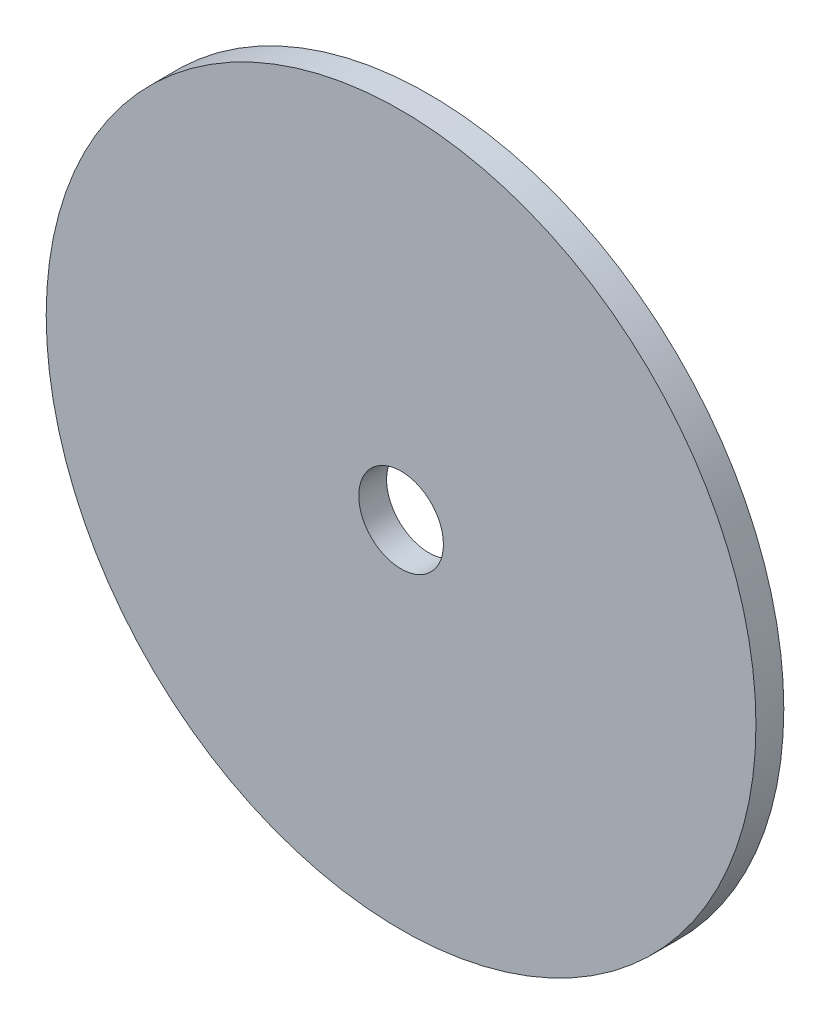
ISO-10303-21;
HEADER;
FILE_DESCRIPTION(('STEP AP214'),'2;1');
FILE_NAME('part.step','',(''),(''),'','','');
FILE_SCHEMA(('AUTOMOTIVE_DESIGN { 1 0 10303 214 1 1 1 1 }'));
ENDSEC;
DATA;
#1=APPLICATION_CONTEXT('core data for automotive mechanical design processes');
#2=APPLICATION_PROTOCOL_DEFINITION('international standard','automotive_design',2000,#1);
#3=PRODUCT_CONTEXT('',#1,'mechanical');
#4=PRODUCT('Part','Part','',(#3));
#5=PRODUCT_RELATED_PRODUCT_CATEGORY('part','',(#4));
#6=PRODUCT_DEFINITION_FORMATION('','',#4);
#7=PRODUCT_DEFINITION_CONTEXT('part definition',#1,'design');
#8=PRODUCT_DEFINITION('design','',#6,#7);
#9=PRODUCT_DEFINITION_SHAPE('','',#8);
#10=(LENGTH_UNIT() NAMED_UNIT(*) SI_UNIT(.MILLI.,.METRE.));
#11=(NAMED_UNIT(*) PLANE_ANGLE_UNIT() SI_UNIT($,.RADIAN.));
#12=(NAMED_UNIT(*) SI_UNIT($,.STERADIAN.) SOLID_ANGLE_UNIT());
#13=UNCERTAINTY_MEASURE_WITH_UNIT(LENGTH_MEASURE(1.E-05),#10,'distance_accuracy_value','');
#14=(GEOMETRIC_REPRESENTATION_CONTEXT(3) GLOBAL_UNCERTAINTY_ASSIGNED_CONTEXT((#13)) GLOBAL_UNIT_ASSIGNED_CONTEXT((#10,
#11,#12)) REPRESENTATION_CONTEXT('',''));
#15=CARTESIAN_POINT('',(0.,0.,0.));
#16=DIRECTION('',(0.,0.,1.));
#17=DIRECTION('',(1.,0.,0.));
#18=AXIS2_PLACEMENT_3D('',#15,#16,#17);
#19=CARTESIAN_POINT('',(0.,0.,5.));
#20=DIRECTION('',(0.,0.,1.));
#21=DIRECTION('',(1.,0.,0.));
#22=AXIS2_PLACEMENT_3D('',#19,#20,#21);
#23=PLANE('',#22);
#24=CARTESIAN_POINT('',(0.,0.,5.));
#25=DIRECTION('',(0.,0.,1.));
#26=DIRECTION('',(1.,0.,0.));
#27=AXIS2_PLACEMENT_3D('',#24,#25,#26);
#28=CIRCLE('',#27,63.7004065395242);
#29=CARTESIAN_POINT('',(63.7004065395242,0.,5.));
#30=VERTEX_POINT('',#29);
#31=EDGE_CURVE('E10',#30,#30,#28,.T.);
#32=ORIENTED_EDGE('',*,*,#31,.T.);
#33=EDGE_LOOP('',(#32));
#34=FACE_BOUND('',#33,.T.);
#35=CARTESIAN_POINT('',(0.,0.,5.));
#36=DIRECTION('',(0.,0.,1.));
#37=DIRECTION('',(1.,0.,0.));
#38=AXIS2_PLACEMENT_3D('',#35,#36,#37);
#39=CIRCLE('',#38,7.6);
#40=CARTESIAN_POINT('',(7.6,0.,5.));
#41=VERTEX_POINT('',#40);
#42=EDGE_CURVE('E58',#41,#41,#39,.T.);
#43=ORIENTED_EDGE('',*,*,#42,.F.);
#44=EDGE_LOOP('',(#43));
#45=FACE_BOUND('',#44,.T.);
#46=ADVANCED_FACE('F45',(#34,#45),#23,.T.);
#47=CARTESIAN_POINT('',(0.,0.,0.));
#48=DIRECTION('',(0.,0.,1.));
#49=DIRECTION('',(1.,0.,0.));
#50=AXIS2_PLACEMENT_3D('',#47,#48,#49);
#51=PLANE('',#50);
#52=CARTESIAN_POINT('',(0.,0.,0.));
#53=DIRECTION('',(0.,0.,1.));
#54=DIRECTION('',(1.,0.,0.));
#55=AXIS2_PLACEMENT_3D('',#52,#53,#54);
#56=CIRCLE('',#55,63.7004065395242);
#57=CARTESIAN_POINT('',(63.7004065395242,0.,0.));
#58=VERTEX_POINT('',#57);
#59=EDGE_CURVE('E49',#58,#58,#56,.T.);
#60=ORIENTED_EDGE('',*,*,#59,.F.);
#61=EDGE_LOOP('',(#60));
#62=FACE_BOUND('',#61,.T.);
#63=CARTESIAN_POINT('',(0.,0.,0.));
#64=DIRECTION('',(0.,0.,1.));
#65=DIRECTION('',(1.,0.,0.));
#66=AXIS2_PLACEMENT_3D('',#63,#64,#65);
#67=CIRCLE('',#66,7.6);
#68=CARTESIAN_POINT('',(7.6,0.,0.));
#69=VERTEX_POINT('',#68);
#70=EDGE_CURVE('E60',#69,#69,#67,.T.);
#71=ORIENTED_EDGE('',*,*,#70,.T.);
#72=EDGE_LOOP('',(#71));
#73=FACE_BOUND('',#72,.T.);
#74=ADVANCED_FACE('F72',(#62,#73),#51,.F.);
#75=CARTESIAN_POINT('',(0.,0.,5.));
#76=DIRECTION('',(0.,0.,-1.));
#77=DIRECTION('',(-1.,0.,0.));
#78=AXIS2_PLACEMENT_3D('',#75,#76,#77);
#79=CYLINDRICAL_SURFACE('',#78,63.7004065395242);
#80=ORIENTED_EDGE('',*,*,#31,.F.);
#81=EDGE_LOOP('',(#80));
#82=FACE_BOUND('',#81,.T.);
#83=ORIENTED_EDGE('',*,*,#59,.T.);
#84=EDGE_LOOP('',(#83));
#85=FACE_BOUND('',#84,.T.);
#86=ADVANCED_FACE('F47',(#82,#85),#79,.T.);
#87=CARTESIAN_POINT('',(0.,0.,5.));
#88=DIRECTION('',(0.,0.,-1.));
#89=DIRECTION('',(-1.,0.,0.));
#90=AXIS2_PLACEMENT_3D('',#87,#88,#89);
#91=CYLINDRICAL_SURFACE('',#90,7.6);
#92=ORIENTED_EDGE('',*,*,#42,.T.);
#93=EDGE_LOOP('',(#92));
#94=FACE_BOUND('',#93,.T.);
#95=ORIENTED_EDGE('',*,*,#70,.F.);
#96=EDGE_LOOP('',(#95));
#97=FACE_BOUND('',#96,.T.);
#98=ADVANCED_FACE('F68',(#94,#97),#91,.F.);
#99=CLOSED_SHELL('',(#46,#74,#86,#98));
#100=MANIFOLD_SOLID_BREP('B2',#99);
#101=ADVANCED_BREP_SHAPE_REPRESENTATION('',(#18,#100),#14);
#102=SHAPE_DEFINITION_REPRESENTATION(#9,#101);
ENDSEC;
END-ISO-10303-21;
